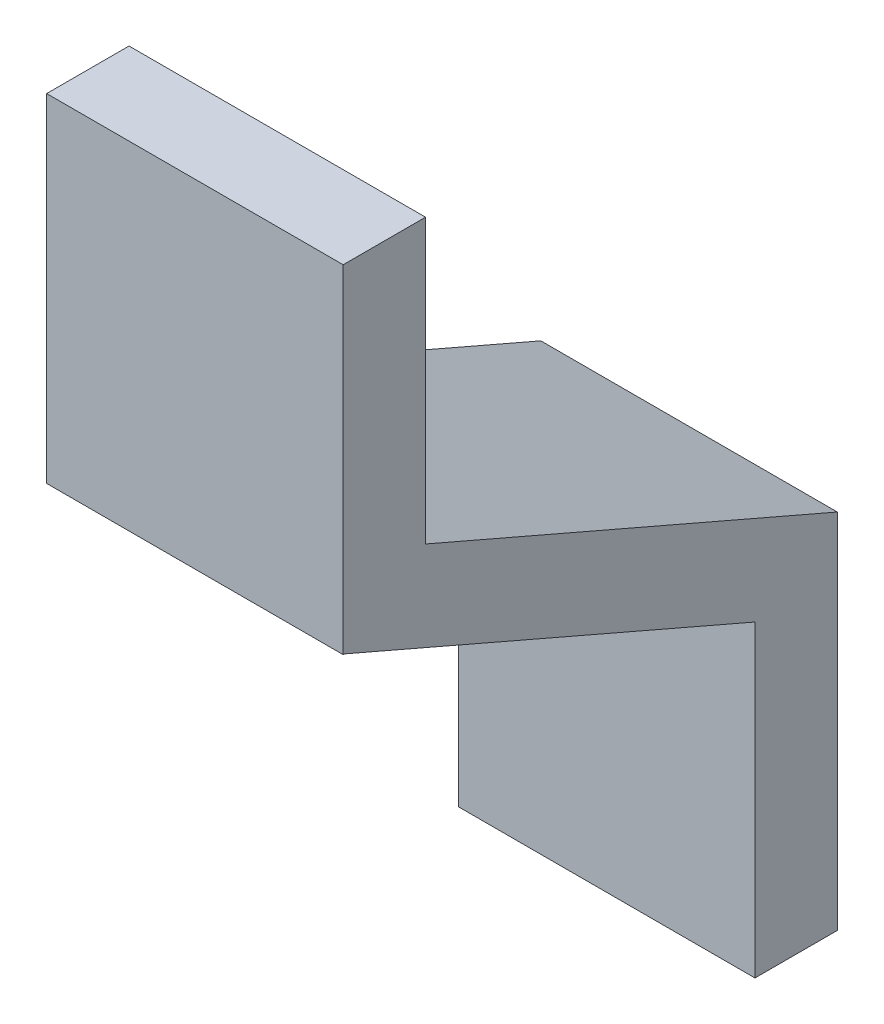
ISO-10303-21;
HEADER;
FILE_DESCRIPTION(('STEP AP214'),'2;1');
FILE_NAME('part.step','',(''),(''),'','','');
FILE_SCHEMA(('AUTOMOTIVE_DESIGN { 1 0 10303 214 1 1 1 1 }'));
ENDSEC;
DATA;
#1=APPLICATION_CONTEXT('core data for automotive mechanical design processes');
#2=APPLICATION_PROTOCOL_DEFINITION('international standard','automotive_design',2000,#1);
#3=PRODUCT_CONTEXT('',#1,'mechanical');
#4=PRODUCT('Part','Part','',(#3));
#5=PRODUCT_RELATED_PRODUCT_CATEGORY('part','',(#4));
#6=PRODUCT_DEFINITION_FORMATION('','',#4);
#7=PRODUCT_DEFINITION_CONTEXT('part definition',#1,'design');
#8=PRODUCT_DEFINITION('design','',#6,#7);
#9=PRODUCT_DEFINITION_SHAPE('','',#8);
#10=(LENGTH_UNIT() NAMED_UNIT(*) SI_UNIT(.MILLI.,.METRE.));
#11=(NAMED_UNIT(*) PLANE_ANGLE_UNIT() SI_UNIT($,.RADIAN.));
#12=(NAMED_UNIT(*) SI_UNIT($,.STERADIAN.) SOLID_ANGLE_UNIT());
#13=UNCERTAINTY_MEASURE_WITH_UNIT(LENGTH_MEASURE(1.E-05),#10,'distance_accuracy_value','');
#14=(GEOMETRIC_REPRESENTATION_CONTEXT(3) GLOBAL_UNCERTAINTY_ASSIGNED_CONTEXT((#13)) GLOBAL_UNIT_ASSIGNED_CONTEXT((#10,
#11,#12)) REPRESENTATION_CONTEXT('',''));
#15=CARTESIAN_POINT('',(0.,0.,0.));
#16=DIRECTION('',(0.,0.,1.));
#17=DIRECTION('',(1.,0.,0.));
#18=AXIS2_PLACEMENT_3D('',#15,#16,#17);
#19=CARTESIAN_POINT('',(5.82,0.999999996424,0.5));
#20=DIRECTION('',(0.,1.,0.));
#21=DIRECTION('',(0.,0.,1.));
#22=AXIS2_PLACEMENT_3D('',#19,#20,#21);
#23=PLANE('',#22);
#24=DIRECTION('',(1.,0.,0.));
#25=VECTOR('',#24,1.);
#26=CARTESIAN_POINT('',(5.82,0.999999996424,0.5));
#27=LINE('',#26,#25);
#28=CARTESIAN_POINT('',(6.180000014305,0.999999996424,0.5));
#29=VERTEX_POINT('',#28);
#30=CARTESIAN_POINT('',(5.82,0.999999996424,0.5));
#31=VERTEX_POINT('',#30);
#32=EDGE_CURVE('E140',#29,#31,#27,.F.);
#33=ORIENTED_EDGE('',*,*,#32,.T.);
#34=DIRECTION('',(0.,0.,-1.));
#35=VECTOR('',#34,1.);
#36=CARTESIAN_POINT('',(5.82,0.999999996424,0.));
#37=LINE('',#36,#35);
#38=CARTESIAN_POINT('',(5.82,0.999999996424,0.60000000149));
#39=VERTEX_POINT('',#38);
#40=EDGE_CURVE('E133',#31,#39,#37,.F.);
#41=ORIENTED_EDGE('',*,*,#40,.T.);
#42=DIRECTION('',(1.,0.,0.));
#43=VECTOR('',#42,1.);
#44=CARTESIAN_POINT('',(5.82,0.999999996424,0.60000000149));
#45=LINE('',#44,#43);
#46=CARTESIAN_POINT('',(6.180000014305,0.999999996424,0.60000000149));
#47=VERTEX_POINT('',#46);
#48=EDGE_CURVE('E129',#47,#39,#45,.F.);
#49=ORIENTED_EDGE('',*,*,#48,.F.);
#50=DIRECTION('',(0.,0.,-1.));
#51=VECTOR('',#50,1.);
#52=CARTESIAN_POINT('',(6.180000014305,0.999999996424,0.));
#53=LINE('',#52,#51);
#54=EDGE_CURVE('E106',#29,#47,#53,.F.);
#55=ORIENTED_EDGE('',*,*,#54,.F.);
#56=EDGE_LOOP('',(#33,#41,#49,#55));
#57=FACE_BOUND('',#56,.T.);
#58=ADVANCED_FACE('F17',(#57),#23,.T.);
#59=CARTESIAN_POINT('',(5.82,0.59,0.60000000149));
#60=DIRECTION('',(0.,0.,1.));
#61=DIRECTION('',(1.,0.,0.));
#62=AXIS2_PLACEMENT_3D('',#59,#60,#61);
#63=PLANE('',#62);
#64=DIRECTION('',(0.,1.,0.));
#65=VECTOR('',#64,1.);
#66=CARTESIAN_POINT('',(5.82,0.44,0.60000000149));
#67=LINE('',#66,#65);
#68=CARTESIAN_POINT('',(5.82,0.59,0.60000000149));
#69=VERTEX_POINT('',#68);
#70=EDGE_CURVE('E136',#39,#69,#67,.F.);
#71=ORIENTED_EDGE('',*,*,#70,.T.);
#72=DIRECTION('',(1.,0.,0.));
#73=VECTOR('',#72,1.);
#74=CARTESIAN_POINT('',(5.82,0.59,0.60000000149));
#75=LINE('',#74,#73);
#76=CARTESIAN_POINT('',(6.180000014305,0.59,0.60000000149));
#77=VERTEX_POINT('',#76);
#78=EDGE_CURVE('E92',#69,#77,#75,.T.);
#79=ORIENTED_EDGE('',*,*,#78,.T.);
#80=DIRECTION('',(0.,1.,0.));
#81=VECTOR('',#80,1.);
#82=CARTESIAN_POINT('',(6.180000014305,0.44,0.60000000149));
#83=LINE('',#82,#81);
#84=EDGE_CURVE('E73',#47,#77,#83,.F.);
#85=ORIENTED_EDGE('',*,*,#84,.F.);
#86=ORIENTED_EDGE('',*,*,#48,.T.);
#87=EDGE_LOOP('',(#71,#79,#85,#86));
#88=FACE_BOUND('',#87,.T.);
#89=ADVANCED_FACE('F285',(#88),#63,.T.);
#90=CARTESIAN_POINT('',(5.82,0.59,0.5));
#91=DIRECTION('',(0.,1.,0.));
#92=DIRECTION('',(0.,0.,1.));
#93=AXIS2_PLACEMENT_3D('',#90,#91,#92);
#94=PLANE('',#93);
#95=DIRECTION('',(1.,0.,0.));
#96=VECTOR('',#95,1.);
#97=CARTESIAN_POINT('',(5.82,0.590000000000416,0.59842599626982));
#98=LINE('',#97,#96);
#99=CARTESIAN_POINT('',(6.180000014305,0.590000000000104,0.598425996269911));
#100=VERTEX_POINT('',#99);
#101=CARTESIAN_POINT('',(5.82,0.590000000000104,0.59842599626991));
#102=VERTEX_POINT('',#101);
#103=EDGE_CURVE('E84',#100,#102,#98,.F.);
#104=ORIENTED_EDGE('',*,*,#103,.F.);
#105=DIRECTION('',(0.,0.,-1.));
#106=VECTOR('',#105,1.);
#107=CARTESIAN_POINT('',(6.180000014305,0.59,0.));
#108=LINE('',#107,#106);
#109=EDGE_CURVE('E20',#77,#100,#108,.T.);
#110=ORIENTED_EDGE('',*,*,#109,.F.);
#111=ORIENTED_EDGE('',*,*,#78,.F.);
#112=DIRECTION('',(0.,0.,1.));
#113=VECTOR('',#112,1.);
#114=CARTESIAN_POINT('',(5.82,0.59,0.5));
#115=LINE('',#114,#113);
#116=EDGE_CURVE('E87',#69,#102,#115,.F.);
#117=ORIENTED_EDGE('',*,*,#116,.T.);
#118=EDGE_LOOP('',(#104,#110,#111,#117));
#119=FACE_BOUND('',#118,.T.);
#120=ADVANCED_FACE('F85',(#119),#94,.F.);
#121=CARTESIAN_POINT('',(5.82,0.348224508223,0.03971472531736));
#122=DIRECTION('',(0.,-0.917754904098641,0.397147247255844));
#123=DIRECTION('',(0.,-0.397147247255844,-0.917754904098641));
#124=AXIS2_PLACEMENT_3D('',#121,#122,#123);
#125=PLANE('',#124);
#126=DIRECTION('',(0.,-0.397147247255413,-0.917754904098827));
#127=VECTOR('',#126,1.);
#128=CARTESIAN_POINT('',(6.180000014305,0.59,0.59842599627));
#129=LINE('',#128,#127);
#130=CARTESIAN_POINT('',(6.180000014305,0.37431222660502,0.10000000149));
#131=VERTEX_POINT('',#130);
#132=EDGE_CURVE('E80',#100,#131,#129,.T.);
#133=ORIENTED_EDGE('',*,*,#132,.F.);
#134=ORIENTED_EDGE('',*,*,#103,.T.);
#135=DIRECTION('',(0.,-0.397147247255413,-0.917754904098827));
#136=VECTOR('',#135,1.);
#137=CARTESIAN_POINT('',(5.82,0.59,0.59842599627));
#138=LINE('',#137,#136);
#139=CARTESIAN_POINT('',(5.82,0.374312226605,0.10000000149));
#140=VERTEX_POINT('',#139);
#141=EDGE_CURVE('E122',#102,#140,#138,.T.);
#142=ORIENTED_EDGE('',*,*,#141,.T.);
#143=DIRECTION('',(1.,0.,0.));
#144=VECTOR('',#143,1.);
#145=CARTESIAN_POINT('',(5.82,0.374312226605,0.10000000149));
#146=LINE('',#145,#144);
#147=EDGE_CURVE('E91',#131,#140,#146,.F.);
#148=ORIENTED_EDGE('',*,*,#147,.F.);
#149=EDGE_LOOP('',(#133,#134,#142,#148));
#150=FACE_BOUND('',#149,.T.);
#151=ADVANCED_FACE('F94',(#150),#125,.T.);
#152=CARTESIAN_POINT('',(5.82,0.,0.10000000149));
#153=DIRECTION('',(0.,0.,1.));
#154=DIRECTION('',(1.,0.,0.));
#155=AXIS2_PLACEMENT_3D('',#152,#153,#154);
#156=PLANE('',#155);
#157=ORIENTED_EDGE('',*,*,#147,.T.);
#158=DIRECTION('',(0.,1.,0.));
#159=VECTOR('',#158,1.);
#160=CARTESIAN_POINT('',(5.82,0.44,0.10000000149));
#161=LINE('',#160,#159);
#162=CARTESIAN_POINT('',(5.82,0.,0.10000000149));
#163=VERTEX_POINT('',#162);
#164=EDGE_CURVE('E118',#140,#163,#161,.F.);
#165=ORIENTED_EDGE('',*,*,#164,.T.);
#166=DIRECTION('',(1.,0.,0.));
#167=VECTOR('',#166,1.);
#168=CARTESIAN_POINT('',(5.82,0.,0.10000000149));
#169=LINE('',#168,#167);
#170=CARTESIAN_POINT('',(6.180000014305,0.,0.10000000149));
#171=VERTEX_POINT('',#170);
#172=EDGE_CURVE('E115',#163,#171,#169,.T.);
#173=ORIENTED_EDGE('',*,*,#172,.T.);
#174=DIRECTION('',(0.,1.,0.));
#175=VECTOR('',#174,1.);
#176=CARTESIAN_POINT('',(6.180000014305,0.44,0.10000000149));
#177=LINE('',#176,#175);
#178=EDGE_CURVE('E96',#131,#171,#177,.F.);
#179=ORIENTED_EDGE('',*,*,#178,.F.);
#180=EDGE_LOOP('',(#157,#165,#173,#179));
#181=FACE_BOUND('',#180,.T.);
#182=ADVANCED_FACE('F202',(#181),#156,.T.);
#183=CARTESIAN_POINT('',(5.82,0.,0.));
#184=DIRECTION('',(0.,1.,0.));
#185=DIRECTION('',(0.,0.,1.));
#186=AXIS2_PLACEMENT_3D('',#183,#184,#185);
#187=PLANE('',#186);
#188=DIRECTION('',(0.,0.,-1.));
#189=VECTOR('',#188,1.);
#190=CARTESIAN_POINT('',(5.82,0.,0.));
#191=LINE('',#190,#189);
#192=CARTESIAN_POINT('',(5.82,0.,0.));
#193=VERTEX_POINT('',#192);
#194=EDGE_CURVE('E121',#163,#193,#191,.T.);
#195=ORIENTED_EDGE('',*,*,#194,.T.);
#196=DIRECTION('',(1.,0.,0.));
#197=VECTOR('',#196,1.);
#198=CARTESIAN_POINT('',(5.82,0.,0.));
#199=LINE('',#198,#197);
#200=CARTESIAN_POINT('',(6.180000014305,0.,0.));
#201=VERTEX_POINT('',#200);
#202=EDGE_CURVE('E112',#193,#201,#199,.T.);
#203=ORIENTED_EDGE('',*,*,#202,.T.);
#204=DIRECTION('',(0.,0.,-1.));
#205=VECTOR('',#204,1.);
#206=CARTESIAN_POINT('',(6.180000014305,0.,0.));
#207=LINE('',#206,#205);
#208=EDGE_CURVE('E98',#171,#201,#207,.T.);
#209=ORIENTED_EDGE('',*,*,#208,.F.);
#210=ORIENTED_EDGE('',*,*,#172,.F.);
#211=EDGE_LOOP('',(#195,#203,#209,#210));
#212=FACE_BOUND('',#211,.T.);
#213=ADVANCED_FACE('F206',(#212),#187,.F.);
#214=CARTESIAN_POINT('',(5.82,0.,0.));
#215=DIRECTION('',(0.,0.,1.));
#216=DIRECTION('',(1.,0.,0.));
#217=AXIS2_PLACEMENT_3D('',#214,#215,#216);
#218=PLANE('',#217);
#219=ORIENTED_EDGE('',*,*,#202,.F.);
#220=DIRECTION('',(0.,1.,0.));
#221=VECTOR('',#220,1.);
#222=CARTESIAN_POINT('',(5.82,0.44,0.));
#223=LINE('',#222,#221);
#224=CARTESIAN_POINT('',(5.82,0.439999998997445,-1.94673175919965E-10));
#225=VERTEX_POINT('',#224);
#226=EDGE_CURVE('E178',#193,#225,#223,.T.);
#227=ORIENTED_EDGE('',*,*,#226,.T.);
#228=DIRECTION('',(1.,0.,0.));
#229=VECTOR('',#228,1.);
#230=CARTESIAN_POINT('',(5.82,0.43999999966303,-7.78692710220355E-10));
#231=LINE('',#230,#229);
#232=CARTESIAN_POINT('',(6.180000014305,0.439999998997445,-1.94673175919965E-10));
#233=VERTEX_POINT('',#232);
#234=EDGE_CURVE('E163',#225,#233,#231,.T.);
#235=ORIENTED_EDGE('',*,*,#234,.T.);
#236=DIRECTION('',(0.,1.,0.));
#237=VECTOR('',#236,1.);
#238=CARTESIAN_POINT('',(6.180000014305,0.44,0.));
#239=LINE('',#238,#237);
#240=EDGE_CURVE('E109',#201,#233,#239,.T.);
#241=ORIENTED_EDGE('',*,*,#240,.F.);
#242=EDGE_LOOP('',(#219,#227,#235,#241));
#243=FACE_BOUND('',#242,.T.);
#244=ADVANCED_FACE('F186',(#243),#218,.F.);
#245=CARTESIAN_POINT('',(6.180000014305,0.44,0.));
#246=DIRECTION('',(1.,0.,0.));
#247=DIRECTION('',(0.,0.,-1.));
#248=AXIS2_PLACEMENT_3D('',#245,#246,#247);
#249=PLANE('',#248);
#250=ORIENTED_EDGE('',*,*,#178,.T.);
#251=ORIENTED_EDGE('',*,*,#208,.T.);
#252=ORIENTED_EDGE('',*,*,#240,.T.);
#253=DIRECTION('',(0.,-0.397147247255844,-0.917754904098641));
#254=VECTOR('',#253,1.);
#255=CARTESIAN_POINT('',(6.180000014305,0.44,0.));
#256=LINE('',#255,#254);
#257=CARTESIAN_POINT('',(6.180000014305,0.656368904967003,0.499999999999999));
#258=VERTEX_POINT('',#257);
#259=EDGE_CURVE('E151',#233,#258,#256,.F.);
#260=ORIENTED_EDGE('',*,*,#259,.T.);
#261=DIRECTION('',(0.,1.,0.));
#262=VECTOR('',#261,1.);
#263=CARTESIAN_POINT('',(6.180000014305,0.59,0.5));
#264=LINE('',#263,#262);
#265=EDGE_CURVE('E144',#258,#29,#264,.T.);
#266=ORIENTED_EDGE('',*,*,#265,.T.);
#267=ORIENTED_EDGE('',*,*,#54,.T.);
#268=ORIENTED_EDGE('',*,*,#84,.T.);
#269=ORIENTED_EDGE('',*,*,#109,.T.);
#270=ORIENTED_EDGE('',*,*,#132,.T.);
#271=EDGE_LOOP('',(#250,#251,#252,#260,#266,#267,#268,#269,#270));
#272=FACE_BOUND('',#271,.T.);
#273=ADVANCED_FACE('F78',(#272),#249,.T.);
#274=CARTESIAN_POINT('',(5.82,0.59,0.5));
#275=DIRECTION('',(0.,0.,1.));
#276=DIRECTION('',(1.,0.,0.));
#277=AXIS2_PLACEMENT_3D('',#274,#275,#276);
#278=PLANE('',#277);
#279=ORIENTED_EDGE('',*,*,#265,.F.);
#280=DIRECTION('',(1.,0.,0.));
#281=VECTOR('',#280,1.);
#282=CARTESIAN_POINT('',(5.82,0.656368904967005,0.499999999999998));
#283=LINE('',#282,#281);
#284=CARTESIAN_POINT('',(5.82,0.656368904967001,0.5));
#285=VERTEX_POINT('',#284);
#286=EDGE_CURVE('E26',#258,#285,#283,.F.);
#287=ORIENTED_EDGE('',*,*,#286,.T.);
#288=DIRECTION('',(0.,1.,0.));
#289=VECTOR('',#288,1.);
#290=CARTESIAN_POINT('',(5.82,0.44,0.5));
#291=LINE('',#290,#289);
#292=EDGE_CURVE('E34',#285,#31,#291,.T.);
#293=ORIENTED_EDGE('',*,*,#292,.T.);
#294=ORIENTED_EDGE('',*,*,#32,.F.);
#295=EDGE_LOOP('',(#279,#287,#293,#294));
#296=FACE_BOUND('',#295,.T.);
#297=ADVANCED_FACE('F212',(#296),#278,.F.);
#298=CARTESIAN_POINT('',(5.82,0.44,0.));
#299=DIRECTION('',(1.,0.,0.));
#300=DIRECTION('',(0.,0.,-1.));
#301=AXIS2_PLACEMENT_3D('',#298,#299,#300);
#302=PLANE('',#301);
#303=ORIENTED_EDGE('',*,*,#226,.F.);
#304=ORIENTED_EDGE('',*,*,#194,.F.);
#305=ORIENTED_EDGE('',*,*,#164,.F.);
#306=ORIENTED_EDGE('',*,*,#141,.F.);
#307=ORIENTED_EDGE('',*,*,#116,.F.);
#308=ORIENTED_EDGE('',*,*,#70,.F.);
#309=ORIENTED_EDGE('',*,*,#40,.F.);
#310=ORIENTED_EDGE('',*,*,#292,.F.);
#311=DIRECTION('',(0.,-0.397147247255844,-0.917754904098641));
#312=VECTOR('',#311,1.);
#313=CARTESIAN_POINT('',(5.82,0.44,0.));
#314=LINE('',#313,#312);
#315=EDGE_CURVE('E11',#285,#225,#314,.T.);
#316=ORIENTED_EDGE('',*,*,#315,.T.);
#317=EDGE_LOOP('',(#303,#304,#305,#306,#307,#308,#309,#310,#316));
#318=FACE_BOUND('',#317,.T.);
#319=ADVANCED_FACE('F207',(#318),#302,.F.);
#320=CARTESIAN_POINT('',(5.82,0.44,0.));
#321=DIRECTION('',(0.,-0.917754904098641,0.397147247255844));
#322=DIRECTION('',(0.,-0.397147247255844,-0.917754904098641));
#323=AXIS2_PLACEMENT_3D('',#320,#321,#322);
#324=PLANE('',#323);
#325=ORIENTED_EDGE('',*,*,#286,.F.);
#326=ORIENTED_EDGE('',*,*,#259,.F.);
#327=ORIENTED_EDGE('',*,*,#234,.F.);
#328=ORIENTED_EDGE('',*,*,#315,.F.);
#329=EDGE_LOOP('',(#325,#326,#327,#328));
#330=FACE_BOUND('',#329,.T.);
#331=ADVANCED_FACE('F193',(#330),#324,.F.);
#332=CLOSED_SHELL('',(#58,#89,#120,#151,#182,#213,#244,#273,#297,#319,#331));
#333=MANIFOLD_SOLID_BREP('B1',#332);
#334=ADVANCED_BREP_SHAPE_REPRESENTATION('',(#18,#333),#14);
#335=SHAPE_DEFINITION_REPRESENTATION(#9,#334);
ENDSEC;
END-ISO-10303-21;
